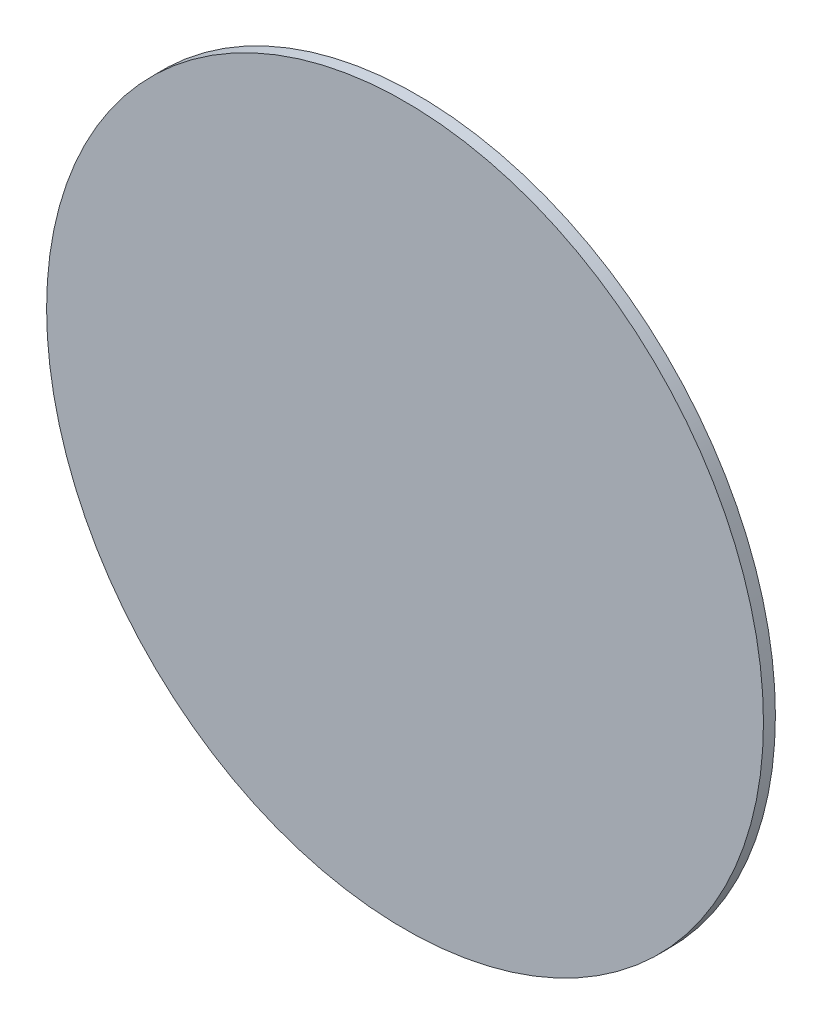
ISO-10303-21;
HEADER;
FILE_DESCRIPTION(('STEP AP214'),'2;1');
FILE_NAME('part.step','',(''),(''),'','','');
FILE_SCHEMA(('AUTOMOTIVE_DESIGN { 1 0 10303 214 1 1 1 1 }'));
ENDSEC;
DATA;
#1=APPLICATION_CONTEXT('core data for automotive mechanical design processes');
#2=APPLICATION_PROTOCOL_DEFINITION('international standard','automotive_design',2000,#1);
#3=PRODUCT_CONTEXT('',#1,'mechanical');
#4=PRODUCT('Part','Part','',(#3));
#5=PRODUCT_RELATED_PRODUCT_CATEGORY('part','',(#4));
#6=PRODUCT_DEFINITION_FORMATION('','',#4);
#7=PRODUCT_DEFINITION_CONTEXT('part definition',#1,'design');
#8=PRODUCT_DEFINITION('design','',#6,#7);
#9=PRODUCT_DEFINITION_SHAPE('','',#8);
#10=(LENGTH_UNIT() NAMED_UNIT(*) SI_UNIT(.MILLI.,.METRE.));
#11=(NAMED_UNIT(*) PLANE_ANGLE_UNIT() SI_UNIT($,.RADIAN.));
#12=(NAMED_UNIT(*) SI_UNIT($,.STERADIAN.) SOLID_ANGLE_UNIT());
#13=UNCERTAINTY_MEASURE_WITH_UNIT(LENGTH_MEASURE(1.E-05),#10,'distance_accuracy_value','');
#14=(GEOMETRIC_REPRESENTATION_CONTEXT(3) GLOBAL_UNCERTAINTY_ASSIGNED_CONTEXT((#13)) GLOBAL_UNIT_ASSIGNED_CONTEXT((#10,
#11,#12)) REPRESENTATION_CONTEXT('',''));
#15=CARTESIAN_POINT('',(0.,0.,0.));
#16=DIRECTION('',(0.,0.,1.));
#17=DIRECTION('',(1.,0.,0.));
#18=AXIS2_PLACEMENT_3D('',#15,#16,#17);
#19=CARTESIAN_POINT('',(0.3,0.,0.01));
#20=DIRECTION('',(0.,0.,-1.));
#21=DIRECTION('',(-1.,0.,0.));
#22=AXIS2_PLACEMENT_3D('',#19,#20,#21);
#23=PLANE('',#22);
#24=CARTESIAN_POINT('',(0.,0.,0.01));
#25=DIRECTION('',(0.,0.,-1.));
#26=DIRECTION('',(-1.,0.,0.));
#27=AXIS2_PLACEMENT_3D('',#24,#25,#26);
#28=CIRCLE('',#27,0.3);
#29=CARTESIAN_POINT('',(-0.3,0.,0.01));
#30=VERTEX_POINT('',#29);
#31=EDGE_CURVE('E18',#30,#30,#28,.T.);
#32=ORIENTED_EDGE('',*,*,#31,.F.);
#33=EDGE_LOOP('',(#32));
#34=FACE_BOUND('',#33,.T.);
#35=ADVANCED_FACE('F15',(#34),#23,.F.);
#36=CARTESIAN_POINT('',(0.,0.,0.));
#37=DIRECTION('',(0.,0.,-1.));
#38=DIRECTION('',(-1.,0.,0.));
#39=AXIS2_PLACEMENT_3D('',#36,#37,#38);
#40=CYLINDRICAL_SURFACE('',#39,0.3);
#41=CARTESIAN_POINT('',(0.,0.,0.));
#42=DIRECTION('',(0.,0.,-1.));
#43=DIRECTION('',(-1.,0.,0.));
#44=AXIS2_PLACEMENT_3D('',#41,#42,#43);
#45=CIRCLE('',#44,0.3);
#46=CARTESIAN_POINT('',(-0.3,0.,0.));
#47=VERTEX_POINT('',#46);
#48=EDGE_CURVE('E10',#47,#47,#45,.T.);
#49=ORIENTED_EDGE('',*,*,#48,.F.);
#50=EDGE_LOOP('',(#49));
#51=FACE_BOUND('',#50,.T.);
#52=ORIENTED_EDGE('',*,*,#31,.T.);
#53=EDGE_LOOP('',(#52));
#54=FACE_BOUND('',#53,.T.);
#55=ADVANCED_FACE('F27',(#51,#54),#40,.T.);
#56=CARTESIAN_POINT('',(0.3,0.,0.));
#57=DIRECTION('',(0.,0.,-1.));
#58=DIRECTION('',(-1.,0.,0.));
#59=AXIS2_PLACEMENT_3D('',#56,#57,#58);
#60=PLANE('',#59);
#61=ORIENTED_EDGE('',*,*,#48,.T.);
#62=EDGE_LOOP('',(#61));
#63=FACE_BOUND('',#62,.T.);
#64=ADVANCED_FACE('F34',(#63),#60,.T.);
#65=CLOSED_SHELL('',(#35,#55,#64));
#66=MANIFOLD_SOLID_BREP('B1',#65);
#67=ADVANCED_BREP_SHAPE_REPRESENTATION('',(#18,#66),#14);
#68=SHAPE_DEFINITION_REPRESENTATION(#9,#67);
ENDSEC;
END-ISO-10303-21;
